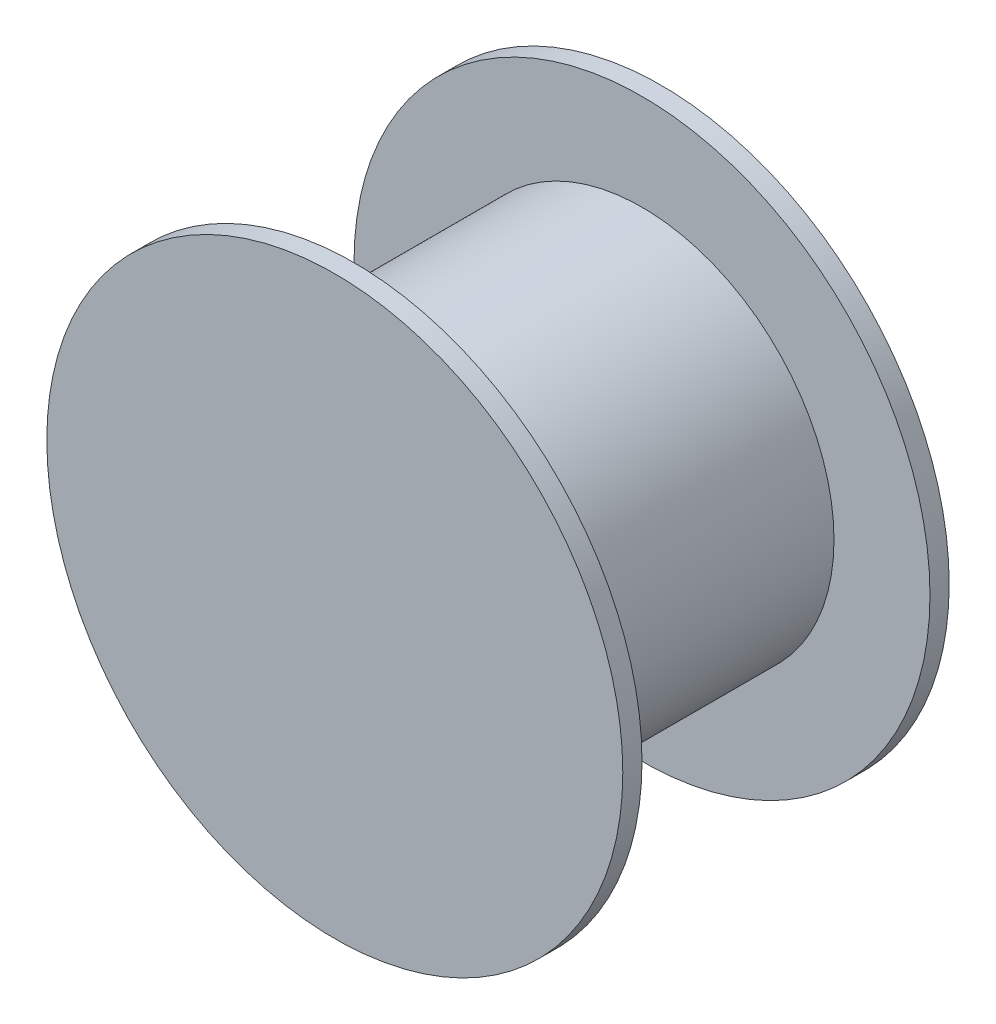
ISO-10303-21;
HEADER;
FILE_DESCRIPTION(('STEP AP214'),'2;1');
FILE_NAME('part.step','',(''),(''),'','','');
FILE_SCHEMA(('AUTOMOTIVE_DESIGN { 1 0 10303 214 1 1 1 1 }'));
ENDSEC;
DATA;
#1=APPLICATION_CONTEXT('core data for automotive mechanical design processes');
#2=APPLICATION_PROTOCOL_DEFINITION('international standard','automotive_design',2000,#1);
#3=PRODUCT_CONTEXT('',#1,'mechanical');
#4=PRODUCT('Part','Part','',(#3));
#5=PRODUCT_RELATED_PRODUCT_CATEGORY('part','',(#4));
#6=PRODUCT_DEFINITION_FORMATION('','',#4);
#7=PRODUCT_DEFINITION_CONTEXT('part definition',#1,'design');
#8=PRODUCT_DEFINITION('design','',#6,#7);
#9=PRODUCT_DEFINITION_SHAPE('','',#8);
#10=(LENGTH_UNIT() NAMED_UNIT(*) SI_UNIT(.MILLI.,.METRE.));
#11=(NAMED_UNIT(*) PLANE_ANGLE_UNIT() SI_UNIT($,.RADIAN.));
#12=(NAMED_UNIT(*) SI_UNIT($,.STERADIAN.) SOLID_ANGLE_UNIT());
#13=UNCERTAINTY_MEASURE_WITH_UNIT(LENGTH_MEASURE(1.E-05),#10,'distance_accuracy_value','');
#14=(GEOMETRIC_REPRESENTATION_CONTEXT(3) GLOBAL_UNCERTAINTY_ASSIGNED_CONTEXT((#13)) GLOBAL_UNIT_ASSIGNED_CONTEXT((#10,
#11,#12)) REPRESENTATION_CONTEXT('',''));
#15=CARTESIAN_POINT('',(0.,0.,0.));
#16=DIRECTION('',(0.,0.,1.));
#17=DIRECTION('',(1.,0.,0.));
#18=AXIS2_PLACEMENT_3D('',#15,#16,#17);
#19=CARTESIAN_POINT('',(0.,0.,10.9));
#20=DIRECTION('',(0.,0.,-1.));
#21=DIRECTION('',(-1.,0.,0.));
#22=AXIS2_PLACEMENT_3D('',#19,#20,#21);
#23=CYLINDRICAL_SURFACE('',#22,4.);
#24=CARTESIAN_POINT('',(0.,0.,4.5));
#25=DIRECTION('',(0.,0.,1.));
#26=DIRECTION('',(1.,0.,0.));
#27=AXIS2_PLACEMENT_3D('',#24,#25,#26);
#28=CIRCLE('',#27,4.);
#29=CARTESIAN_POINT('',(4.,0.,4.5));
#30=VERTEX_POINT('',#29);
#31=EDGE_CURVE('E60',#30,#30,#28,.T.);
#32=ORIENTED_EDGE('',*,*,#31,.T.);
#33=EDGE_LOOP('',(#32));
#34=FACE_BOUND('',#33,.T.);
#35=CARTESIAN_POINT('',(0.,0.,10.5));
#36=DIRECTION('',(0.,0.,1.));
#37=DIRECTION('',(1.,0.,0.));
#38=AXIS2_PLACEMENT_3D('',#35,#36,#37);
#39=CIRCLE('',#38,4.);
#40=CARTESIAN_POINT('',(4.,0.,10.5));
#41=VERTEX_POINT('',#40);
#42=EDGE_CURVE('E10',#41,#41,#39,.T.);
#43=ORIENTED_EDGE('',*,*,#42,.F.);
#44=EDGE_LOOP('',(#43));
#45=FACE_BOUND('',#44,.T.);
#46=ADVANCED_FACE('F42',(#34,#45),#23,.T.);
#47=CARTESIAN_POINT('',(0.,0.,10.5));
#48=DIRECTION('',(0.,0.,1.));
#49=DIRECTION('',(1.,0.,0.));
#50=AXIS2_PLACEMENT_3D('',#47,#48,#49);
#51=CYLINDRICAL_SURFACE('',#50,6.);
#52=CARTESIAN_POINT('',(0.,0.,10.5));
#53=DIRECTION('',(0.,0.,1.));
#54=DIRECTION('',(1.,0.,0.));
#55=AXIS2_PLACEMENT_3D('',#52,#53,#54);
#56=CIRCLE('',#55,6.);
#57=CARTESIAN_POINT('',(6.,0.,10.5));
#58=VERTEX_POINT('',#57);
#59=EDGE_CURVE('E49',#58,#58,#56,.T.);
#60=ORIENTED_EDGE('',*,*,#59,.T.);
#61=EDGE_LOOP('',(#60));
#62=FACE_BOUND('',#61,.T.);
#63=CARTESIAN_POINT('',(0.,0.,10.9));
#64=DIRECTION('',(0.,0.,1.));
#65=DIRECTION('',(1.,0.,0.));
#66=AXIS2_PLACEMENT_3D('',#63,#64,#65);
#67=CIRCLE('',#66,6.);
#68=CARTESIAN_POINT('',(6.,0.,10.9));
#69=VERTEX_POINT('',#68);
#70=EDGE_CURVE('E54',#69,#69,#67,.T.);
#71=ORIENTED_EDGE('',*,*,#70,.F.);
#72=EDGE_LOOP('',(#71));
#73=FACE_BOUND('',#72,.T.);
#74=ADVANCED_FACE('F91',(#62,#73),#51,.T.);
#75=CARTESIAN_POINT('',(0.,0.,10.5));
#76=DIRECTION('',(0.,0.,1.));
#77=DIRECTION('',(1.,0.,0.));
#78=AXIS2_PLACEMENT_3D('',#75,#76,#77);
#79=PLANE('',#78);
#80=ORIENTED_EDGE('',*,*,#42,.T.);
#81=EDGE_LOOP('',(#80));
#82=FACE_BOUND('',#81,.T.);
#83=ORIENTED_EDGE('',*,*,#59,.F.);
#84=EDGE_LOOP('',(#83));
#85=FACE_BOUND('',#84,.T.);
#86=ADVANCED_FACE('F95',(#82,#85),#79,.F.);
#87=CARTESIAN_POINT('',(0.,0.,10.9));
#88=DIRECTION('',(0.,0.,1.));
#89=DIRECTION('',(1.,0.,0.));
#90=AXIS2_PLACEMENT_3D('',#87,#88,#89);
#91=PLANE('',#90);
#92=ORIENTED_EDGE('',*,*,#70,.T.);
#93=EDGE_LOOP('',(#92));
#94=FACE_BOUND('',#93,.T.);
#95=ADVANCED_FACE('F101',(#94),#91,.T.);
#96=CARTESIAN_POINT('',(0.,0.,4.5));
#97=DIRECTION('',(0.,0.,-1.));
#98=DIRECTION('',(-1.,0.,0.));
#99=AXIS2_PLACEMENT_3D('',#96,#97,#98);
#100=CYLINDRICAL_SURFACE('',#99,6.);
#101=CARTESIAN_POINT('',(0.,0.,4.5));
#102=DIRECTION('',(0.,0.,1.));
#103=DIRECTION('',(1.,0.,0.));
#104=AXIS2_PLACEMENT_3D('',#101,#102,#103);
#105=CIRCLE('',#104,6.);
#106=CARTESIAN_POINT('',(6.,0.,4.5));
#107=VERTEX_POINT('',#106);
#108=EDGE_CURVE('E67',#107,#107,#105,.T.);
#109=ORIENTED_EDGE('',*,*,#108,.F.);
#110=EDGE_LOOP('',(#109));
#111=FACE_BOUND('',#110,.T.);
#112=CARTESIAN_POINT('',(0.,0.,4.1));
#113=DIRECTION('',(0.,0.,1.));
#114=DIRECTION('',(1.,0.,0.));
#115=AXIS2_PLACEMENT_3D('',#112,#113,#114);
#116=CIRCLE('',#115,6.);
#117=CARTESIAN_POINT('',(6.,0.,4.1));
#118=VERTEX_POINT('',#117);
#119=EDGE_CURVE('E63',#118,#118,#116,.T.);
#120=ORIENTED_EDGE('',*,*,#119,.T.);
#121=EDGE_LOOP('',(#120));
#122=FACE_BOUND('',#121,.T.);
#123=ADVANCED_FACE('F78',(#111,#122),#100,.T.);
#124=CARTESIAN_POINT('',(0.,0.,4.5));
#125=DIRECTION('',(0.,0.,-1.));
#126=DIRECTION('',(1.,0.,0.));
#127=AXIS2_PLACEMENT_3D('',#124,#125,#126);
#128=PLANE('',#127);
#129=ORIENTED_EDGE('',*,*,#31,.F.);
#130=EDGE_LOOP('',(#129));
#131=FACE_BOUND('',#130,.T.);
#132=ORIENTED_EDGE('',*,*,#108,.T.);
#133=EDGE_LOOP('',(#132));
#134=FACE_BOUND('',#133,.T.);
#135=ADVANCED_FACE('F82',(#131,#134),#128,.F.);
#136=CARTESIAN_POINT('',(0.,0.,4.1));
#137=DIRECTION('',(0.,0.,-1.));
#138=DIRECTION('',(1.,0.,0.));
#139=AXIS2_PLACEMENT_3D('',#136,#137,#138);
#140=PLANE('',#139);
#141=ORIENTED_EDGE('',*,*,#119,.F.);
#142=EDGE_LOOP('',(#141));
#143=FACE_BOUND('',#142,.T.);
#144=ADVANCED_FACE('F80',(#143),#140,.T.);
#145=CLOSED_SHELL('',(#46,#74,#86,#95,#123,#135,#144));
#146=MANIFOLD_SOLID_BREP('B2',#145);
#147=ADVANCED_BREP_SHAPE_REPRESENTATION('',(#18,#146),#14);
#148=SHAPE_DEFINITION_REPRESENTATION(#9,#147);
ENDSEC;
END-ISO-10303-21;
